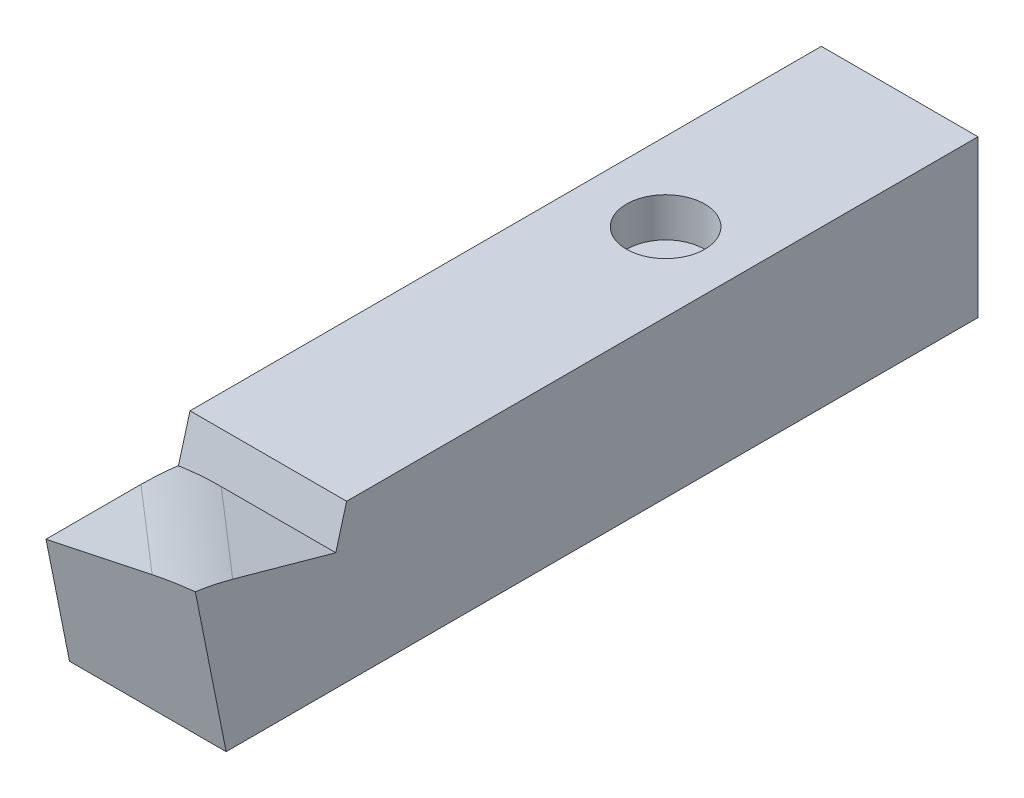
ISO-10303-21;
HEADER;
FILE_DESCRIPTION(('STEP AP214'),'2;1');
FILE_NAME('part.step','',(''),(''),'','','');
FILE_SCHEMA(('AUTOMOTIVE_DESIGN { 1 0 10303 214 1 1 1 1 }'));
ENDSEC;
DATA;
#1=APPLICATION_CONTEXT('core data for automotive mechanical design processes');
#2=APPLICATION_PROTOCOL_DEFINITION('international standard','automotive_design',2000,#1);
#3=PRODUCT_CONTEXT('',#1,'mechanical');
#4=PRODUCT('Part','Part','',(#3));
#5=PRODUCT_RELATED_PRODUCT_CATEGORY('part','',(#4));
#6=PRODUCT_DEFINITION_FORMATION('','',#4);
#7=PRODUCT_DEFINITION_CONTEXT('part definition',#1,'design');
#8=PRODUCT_DEFINITION('design','',#6,#7);
#9=PRODUCT_DEFINITION_SHAPE('','',#8);
#10=(LENGTH_UNIT() NAMED_UNIT(*) SI_UNIT(.MILLI.,.METRE.));
#11=(NAMED_UNIT(*) PLANE_ANGLE_UNIT() SI_UNIT($,.RADIAN.));
#12=(NAMED_UNIT(*) SI_UNIT($,.STERADIAN.) SOLID_ANGLE_UNIT());
#13=UNCERTAINTY_MEASURE_WITH_UNIT(LENGTH_MEASURE(1.E-05),#10,'distance_accuracy_value','');
#14=(GEOMETRIC_REPRESENTATION_CONTEXT(3) GLOBAL_UNCERTAINTY_ASSIGNED_CONTEXT((#13)) GLOBAL_UNIT_ASSIGNED_CONTEXT((#10,
#11,#12)) REPRESENTATION_CONTEXT('',''));
#15=CARTESIAN_POINT('',(0.,0.,0.));
#16=DIRECTION('',(0.,0.,1.));
#17=DIRECTION('',(1.,0.,0.));
#18=AXIS2_PLACEMENT_3D('',#15,#16,#17);
#19=CARTESIAN_POINT('',(10.,10.,-100.));
#20=DIRECTION('',(1.,0.,0.));
#21=DIRECTION('',(0.,0.,-1.));
#22=AXIS2_PLACEMENT_3D('',#19,#20,#21);
#23=PLANE('',#22);
#24=DIRECTION('',(0.,-0.267643863786095,-0.963517909629941));
#25=VECTOR('',#24,1.);
#26=CARTESIAN_POINT('',(10.,9.28366762177651,-2.57879656160459));
#27=LINE('',#26,#25);
#28=CARTESIAN_POINT('',(10.,8.65483006451051,-4.84261176776216));
#29=VERTEX_POINT('',#28);
#30=CARTESIAN_POINT('',(10.,5.,-18.));
#31=VERTEX_POINT('',#30);
#32=EDGE_CURVE('E199',#29,#31,#27,.T.);
#33=ORIENTED_EDGE('',*,*,#32,.F.);
#34=CARTESIAN_POINT('',(10.,-10.6155281280883,0.51026550795974));
#35=DIRECTION('',(1.,0.,0.));
#36=DIRECTION('',(0.,0.267643863786095,0.963517909629941));
#37=AXIS2_PLACEMENT_3D('',#34,#35,#36);
#38=ELLIPSE('',#37,27.367864366808,20.);
#39=CARTESIAN_POINT('',(10.,9.64998144961576,-0.0700037100768436));
#40=VERTEX_POINT('',#39);
#41=EDGE_CURVE('E134',#29,#40,#38,.T.);
#42=ORIENTED_EDGE('',*,*,#41,.T.);
#43=DIRECTION('',(0.,-0.98058067569092,-0.196116135138184));
#44=VECTOR('',#43,1.);
#45=CARTESIAN_POINT('',(10.,0.384615384615372,-1.92307692307692));
#46=LINE('',#45,#44);
#47=CARTESIAN_POINT('',(10.,-10.,-4.));
#48=VERTEX_POINT('',#47);
#49=EDGE_CURVE('E127',#40,#48,#46,.T.);
#50=ORIENTED_EDGE('',*,*,#49,.T.);
#51=DIRECTION('',(0.,0.,1.));
#52=VECTOR('',#51,1.);
#53=CARTESIAN_POINT('',(10.,-10.,-100.));
#54=LINE('',#53,#52);
#55=CARTESIAN_POINT('',(10.,-10.,-100.));
#56=VERTEX_POINT('',#55);
#57=EDGE_CURVE('E132',#56,#48,#54,.T.);
#58=ORIENTED_EDGE('',*,*,#57,.F.);
#59=DIRECTION('',(0.,1.,0.));
#60=VECTOR('',#59,1.);
#61=CARTESIAN_POINT('',(10.,10.,-100.));
#62=LINE('',#61,#60);
#63=CARTESIAN_POINT('',(10.,10.,-100.));
#64=VERTEX_POINT('',#63);
#65=EDGE_CURVE('E207',#56,#64,#62,.T.);
#66=ORIENTED_EDGE('',*,*,#65,.T.);
#67=DIRECTION('',(0.,0.,1.));
#68=VECTOR('',#67,1.);
#69=CARTESIAN_POINT('',(10.,10.,-100.));
#70=LINE('',#69,#68);
#71=CARTESIAN_POINT('',(10.,10.,-19.3888888888889));
#72=VERTEX_POINT('',#71);
#73=EDGE_CURVE('E171',#64,#72,#70,.T.);
#74=ORIENTED_EDGE('',*,*,#73,.T.);
#75=DIRECTION('',(0.,0.963517909629941,-0.267643863786094));
#76=VECTOR('',#75,1.);
#77=CARTESIAN_POINT('',(10.,-4.28366762177651,-15.4212034383954));
#78=LINE('',#77,#76);
#79=EDGE_CURVE('E209',#31,#72,#78,.T.);
#80=ORIENTED_EDGE('',*,*,#79,.F.);
#81=EDGE_LOOP('',(#33,#42,#50,#58,#66,#74,#80));
#82=FACE_BOUND('',#81,.T.);
#83=ADVANCED_FACE('F62',(#82),#23,.T.);
#84=CARTESIAN_POINT('',(-10.,-10.,-100.));
#85=DIRECTION('',(0.,-1.,0.));
#86=DIRECTION('',(0.,0.,-1.));
#87=AXIS2_PLACEMENT_3D('',#84,#85,#86);
#88=PLANE('',#87);
#89=ORIENTED_EDGE('',*,*,#57,.T.);
#90=DIRECTION('',(1.,0.,0.));
#91=VECTOR('',#90,1.);
#92=CARTESIAN_POINT('',(-10.,-10.,-4.));
#93=LINE('',#92,#91);
#94=CARTESIAN_POINT('',(-10.,-10.,-4.));
#95=VERTEX_POINT('',#94);
#96=EDGE_CURVE('E138',#95,#48,#93,.T.);
#97=ORIENTED_EDGE('',*,*,#96,.F.);
#98=DIRECTION('',(0.,0.,1.));
#99=VECTOR('',#98,1.);
#100=CARTESIAN_POINT('',(-10.,-10.,-100.));
#101=LINE('',#100,#99);
#102=CARTESIAN_POINT('',(-10.,-10.,-100.));
#103=VERTEX_POINT('',#102);
#104=EDGE_CURVE('E156',#103,#95,#101,.T.);
#105=ORIENTED_EDGE('',*,*,#104,.F.);
#106=DIRECTION('',(1.,0.,0.));
#107=VECTOR('',#106,1.);
#108=CARTESIAN_POINT('',(-10.,-10.,-100.));
#109=LINE('',#108,#107);
#110=EDGE_CURVE('E153',#103,#56,#109,.T.);
#111=ORIENTED_EDGE('',*,*,#110,.T.);
#112=EDGE_LOOP('',(#89,#97,#105,#111));
#113=FACE_BOUND('',#112,.T.);
#114=ADVANCED_FACE('F151',(#113),#88,.T.);
#115=CARTESIAN_POINT('',(-10.,10.,-100.));
#116=DIRECTION('',(-1.,0.,0.));
#117=DIRECTION('',(0.,-1.,0.));
#118=AXIS2_PLACEMENT_3D('',#115,#116,#117);
#119=PLANE('',#118);
#120=CARTESIAN_POINT('',(-10.,-15.6155281280883,-17.4897344920403));
#121=DIRECTION('',(-1.,0.,0.));
#122=DIRECTION('',(0.,0.267643863786095,0.963517909629941));
#123=AXIS2_PLACEMENT_3D('',#120,#121,#122);
#124=ELLIPSE('',#123,27.367864366808,20.);
#125=CARTESIAN_POINT('',(-10.,5.,-13.1240932413863));
#126=VERTEX_POINT('',#125);
#127=CARTESIAN_POINT('',(-10.,4.67226215837613,-17.90896171066));
#128=VERTEX_POINT('',#127);
#129=EDGE_CURVE('E71',#126,#128,#124,.T.);
#130=ORIENTED_EDGE('',*,*,#129,.T.);
#131=DIRECTION('',(0.,0.963517909629941,-0.267643863786094));
#132=VECTOR('',#131,1.);
#133=CARTESIAN_POINT('',(-10.,-4.28366762177651,-15.4212034383954));
#134=LINE('',#133,#132);
#135=CARTESIAN_POINT('',(-10.,10.,-19.3888888888889));
#136=VERTEX_POINT('',#135);
#137=EDGE_CURVE('E77',#128,#136,#134,.T.);
#138=ORIENTED_EDGE('',*,*,#137,.T.);
#139=DIRECTION('',(0.,0.,1.));
#140=VECTOR('',#139,1.);
#141=CARTESIAN_POINT('',(-10.,10.,-100.));
#142=LINE('',#141,#140);
#143=CARTESIAN_POINT('',(-10.,10.,-100.));
#144=VERTEX_POINT('',#143);
#145=EDGE_CURVE('E163',#144,#136,#142,.T.);
#146=ORIENTED_EDGE('',*,*,#145,.F.);
#147=DIRECTION('',(0.,-1.,0.));
#148=VECTOR('',#147,1.);
#149=CARTESIAN_POINT('',(-10.,10.,-100.));
#150=LINE('',#149,#148);
#151=EDGE_CURVE('E218',#144,#103,#150,.T.);
#152=ORIENTED_EDGE('',*,*,#151,.T.);
#153=ORIENTED_EDGE('',*,*,#104,.T.);
#154=DIRECTION('',(0.,-0.98058067569092,-0.196116135138184));
#155=VECTOR('',#154,1.);
#156=CARTESIAN_POINT('',(-10.,0.384615384615372,-1.92307692307692));
#157=LINE('',#156,#155);
#158=CARTESIAN_POINT('',(-10.,5.,-1.));
#159=VERTEX_POINT('',#158);
#160=EDGE_CURVE('E145',#159,#95,#157,.T.);
#161=ORIENTED_EDGE('',*,*,#160,.F.);
#162=DIRECTION('',(0.,0.,1.));
#163=VECTOR('',#162,1.);
#164=CARTESIAN_POINT('',(-10.,5.,-18.));
#165=LINE('',#164,#163);
#166=EDGE_CURVE('E139',#126,#159,#165,.T.);
#167=ORIENTED_EDGE('',*,*,#166,.F.);
#168=EDGE_LOOP('',(#130,#138,#146,#152,#153,#161,#167));
#169=FACE_BOUND('',#168,.T.);
#170=ADVANCED_FACE('F189',(#169),#119,.T.);
#171=CARTESIAN_POINT('',(-10.,10.,-100.));
#172=DIRECTION('',(0.,1.,0.));
#173=DIRECTION('',(0.,0.,1.));
#174=AXIS2_PLACEMENT_3D('',#171,#172,#173);
#175=PLANE('',#174);
#176=CARTESIAN_POINT('',(0.,10.,-70.1147084116696));
#177=DIRECTION('',(0.,1.,0.));
#178=DIRECTION('',(0.,0.,1.));
#179=AXIS2_PLACEMENT_3D('',#176,#177,#178);
#180=CIRCLE('',#179,5.);
#181=CARTESIAN_POINT('',(0.,10.,-65.1147084116696));
#182=VERTEX_POINT('',#181);
#183=EDGE_CURVE('E243',#182,#182,#180,.T.);
#184=ORIENTED_EDGE('',*,*,#183,.F.);
#185=EDGE_LOOP('',(#184));
#186=FACE_BOUND('',#185,.T.);
#187=DIRECTION('',(1.,0.,0.));
#188=VECTOR('',#187,1.);
#189=CARTESIAN_POINT('',(-10.,10.,-19.3888888888889));
#190=LINE('',#189,#188);
#191=EDGE_CURVE('E201',#136,#72,#190,.T.);
#192=ORIENTED_EDGE('',*,*,#191,.T.);
#193=ORIENTED_EDGE('',*,*,#73,.F.);
#194=DIRECTION('',(-1.,0.,0.));
#195=VECTOR('',#194,1.);
#196=CARTESIAN_POINT('',(-10.,10.,-100.));
#197=LINE('',#196,#195);
#198=EDGE_CURVE('E215',#64,#144,#197,.T.);
#199=ORIENTED_EDGE('',*,*,#198,.T.);
#200=ORIENTED_EDGE('',*,*,#145,.T.);
#201=EDGE_LOOP('',(#192,#193,#199,#200));
#202=FACE_BOUND('',#201,.T.);
#203=ADVANCED_FACE('F232',(#186,#202),#175,.T.);
#204=CARTESIAN_POINT('',(0.,0.,-100.));
#205=DIRECTION('',(0.,0.,1.));
#206=DIRECTION('',(1.,0.,0.));
#207=AXIS2_PLACEMENT_3D('',#204,#205,#206);
#208=PLANE('',#207);
#209=ORIENTED_EDGE('',*,*,#65,.F.);
#210=ORIENTED_EDGE('',*,*,#110,.F.);
#211=ORIENTED_EDGE('',*,*,#151,.F.);
#212=ORIENTED_EDGE('',*,*,#198,.F.);
#213=EDGE_LOOP('',(#209,#210,#211,#212));
#214=FACE_BOUND('',#213,.T.);
#215=ADVANCED_FACE('F230',(#214),#208,.F.);
#216=CARTESIAN_POINT('',(-10.,9.28366762177651,-2.57879656160459));
#217=DIRECTION('',(0.,-0.963517909629941,0.267643863786095));
#218=DIRECTION('',(0.,-0.267643863786095,-0.963517909629941));
#219=AXIS2_PLACEMENT_3D('',#216,#217,#218);
#220=PLANE('',#219);
#221=DIRECTION('',(1.,0.,0.));
#222=VECTOR('',#221,1.);
#223=CARTESIAN_POINT('',(-10.,5.,-18.));
#224=LINE('',#223,#222);
#225=CARTESIAN_POINT('',(-4.61932025804201,5.,-18.));
#226=VERTEX_POINT('',#225);
#227=EDGE_CURVE('E195',#226,#31,#224,.T.);
#228=ORIENTED_EDGE('',*,*,#227,.F.);
#229=DIRECTION('',(0.73078409524187,0.182696023810467,0.657705685717683));
#230=VECTOR('',#229,1.);
#231=CARTESIAN_POINT('',(0.491131148121937,6.27761285154099,-13.4005937344524));
#232=LINE('',#231,#230);
#233=EDGE_CURVE('E161',#226,#29,#232,.T.);
#234=ORIENTED_EDGE('',*,*,#233,.T.);
#235=ORIENTED_EDGE('',*,*,#32,.T.);
#236=EDGE_LOOP('',(#228,#234,#235));
#237=FACE_BOUND('',#236,.T.);
#238=ADVANCED_FACE('F198',(#237),#220,.F.);
#239=CARTESIAN_POINT('',(-10.,-4.28366762177651,-15.4212034383954));
#240=DIRECTION('',(0.,-0.267643863786094,-0.963517909629941));
#241=DIRECTION('',(0.,0.963517909629941,-0.267643863786094));
#242=AXIS2_PLACEMENT_3D('',#239,#240,#241);
#243=PLANE('',#242);
#244=ORIENTED_EDGE('',*,*,#79,.T.);
#245=ORIENTED_EDGE('',*,*,#191,.F.);
#246=ORIENTED_EDGE('',*,*,#137,.F.);
#247=CARTESIAN_POINT('',(-4.61932025804207,-14.2703581925988,-12.6471227242781));
#248=DIRECTION('',(0.,-0.267643863786094,-0.963517909629941));
#249=DIRECTION('',(1.,0.,0.));
#250=AXIS2_PLACEMENT_3D('',#247,#248,#249);
#251=ELLIPSE('',#250,29.2993638508251,20.);
#252=EDGE_CURVE('E12',#128,#226,#251,.T.);
#253=ORIENTED_EDGE('',*,*,#252,.T.);
#254=ORIENTED_EDGE('',*,*,#227,.T.);
#255=EDGE_LOOP('',(#244,#245,#246,#253,#254));
#256=FACE_BOUND('',#255,.T.);
#257=ADVANCED_FACE('F194',(#256),#243,.F.);
#258=CARTESIAN_POINT('',(-10.,0.384615384615372,-1.92307692307692));
#259=DIRECTION('',(0.,-0.196116135138184,0.98058067569092));
#260=DIRECTION('',(0.,-0.98058067569092,-0.196116135138184));
#261=AXIS2_PLACEMENT_3D('',#258,#259,#260);
#262=PLANE('',#261);
#263=ORIENTED_EDGE('',*,*,#49,.F.);
#264=CARTESIAN_POINT('',(4.54897513696778,-11.9782843438464,-4.39565686876928));
#265=DIRECTION('',(0.,-0.196116135138184,0.98058067569092));
#266=DIRECTION('',(0.921438496021943,0.380979378162919,0.0761958756325837));
#267=AXIS2_PLACEMENT_3D('',#264,#265,#266);
#268=ELLIPSE('',#267,32.8351234004035,20.);
#269=CARTESIAN_POINT('',(4.26363910751326,8.56590977687832,-0.286818044624326));
#270=VERTEX_POINT('',#269);
#271=EDGE_CURVE('E180',#40,#270,#268,.T.);
#272=ORIENTED_EDGE('',*,*,#271,.T.);
#273=DIRECTION('',(0.969003166223019,0.242250791555755,0.0484501583111509));
#274=VECTOR('',#273,1.);
#275=CARTESIAN_POINT('',(-11.1267605633803,4.71830985915492,-1.05633802816901));
#276=LINE('',#275,#274);
#277=EDGE_CURVE('E155',#159,#270,#276,.T.);
#278=ORIENTED_EDGE('',*,*,#277,.F.);
#279=ORIENTED_EDGE('',*,*,#160,.T.);
#280=ORIENTED_EDGE('',*,*,#96,.T.);
#281=EDGE_LOOP('',(#263,#272,#278,#279,#280));
#282=FACE_BOUND('',#281,.T.);
#283=ADVANCED_FACE('F142',(#282),#262,.T.);
#284=CARTESIAN_POINT('',(-10.,5.,-18.));
#285=DIRECTION('',(0.242535625036333,-0.970142500145332,0.));
#286=DIRECTION('',(0.970142500145332,0.242535625036333,0.));
#287=AXIS2_PLACEMENT_3D('',#284,#285,#286);
#288=PLANE('',#287);
#289=ORIENTED_EDGE('',*,*,#277,.T.);
#290=DIRECTION('',(0.73078409524187,0.182696023810467,0.657705685717683));
#291=VECTOR('',#290,1.);
#292=CARTESIAN_POINT('',(-12.343559990789,4.41411000230277,-15.2332972330964));
#293=LINE('',#292,#291);
#294=EDGE_CURVE('E85',#270,#126,#293,.F.);
#295=ORIENTED_EDGE('',*,*,#294,.T.);
#296=ORIENTED_EDGE('',*,*,#166,.T.);
#297=EDGE_LOOP('',(#289,#295,#296));
#298=FACE_BOUND('',#297,.T.);
#299=ADVANCED_FACE('F282',(#298),#288,.F.);
#300=CARTESIAN_POINT('',(0.491131148121937,-12.9927453410578,-8.04771645873054));
#301=DIRECTION('',(0.73078409524187,0.182696023810467,0.657705685717683));
#302=DIRECTION('',(0.66896473162245,0.,-0.743294146247166));
#303=AXIS2_PLACEMENT_3D('',#300,#301,#302);
#304=CYLINDRICAL_SURFACE('',#303,20.);
#305=ORIENTED_EDGE('',*,*,#129,.F.);
#306=ORIENTED_EDGE('',*,*,#294,.F.);
#307=ORIENTED_EDGE('',*,*,#271,.F.);
#308=ORIENTED_EDGE('',*,*,#41,.F.);
#309=ORIENTED_EDGE('',*,*,#233,.F.);
#310=ORIENTED_EDGE('',*,*,#252,.F.);
#311=EDGE_LOOP('',(#305,#306,#307,#308,#309,#310));
#312=FACE_BOUND('',#311,.T.);
#313=ADVANCED_FACE('F64',(#312),#304,.T.);
#314=CARTESIAN_POINT('',(0.,5.,-70.1147084116696));
#315=DIRECTION('',(0.,1.,0.));
#316=DIRECTION('',(0.,0.,1.));
#317=AXIS2_PLACEMENT_3D('',#314,#315,#316);
#318=CYLINDRICAL_SURFACE('',#317,5.);
#319=CARTESIAN_POINT('',(0.,5.,-70.1147084116696));
#320=DIRECTION('',(0.,1.,0.));
#321=DIRECTION('',(0.,0.,1.));
#322=AXIS2_PLACEMENT_3D('',#319,#320,#321);
#323=CIRCLE('',#322,5.);
#324=CARTESIAN_POINT('',(0.,5.,-65.1147084116696));
#325=VERTEX_POINT('',#324);
#326=EDGE_CURVE('E242',#325,#325,#323,.T.);
#327=ORIENTED_EDGE('',*,*,#326,.F.);
#328=EDGE_LOOP('',(#327));
#329=FACE_BOUND('',#328,.T.);
#330=ORIENTED_EDGE('',*,*,#183,.T.);
#331=EDGE_LOOP('',(#330));
#332=FACE_BOUND('',#331,.T.);
#333=ADVANCED_FACE('F254',(#329,#332),#318,.F.);
#334=CARTESIAN_POINT('',(0.,5.,-70.1147084116696));
#335=DIRECTION('',(0.,1.,0.));
#336=DIRECTION('',(0.,0.,1.));
#337=AXIS2_PLACEMENT_3D('',#334,#335,#336);
#338=PLANE('',#337);
#339=ORIENTED_EDGE('',*,*,#326,.T.);
#340=EDGE_LOOP('',(#339));
#341=FACE_BOUND('',#340,.T.);
#342=ADVANCED_FACE('F252',(#341),#338,.T.);
#343=CLOSED_SHELL('',(#83,#114,#170,#203,#215,#238,#257,#283,#299,#313,#333,#342));
#344=MANIFOLD_SOLID_BREP('B2',#343);
#345=ADVANCED_BREP_SHAPE_REPRESENTATION('',(#18,#344),#14);
#346=SHAPE_DEFINITION_REPRESENTATION(#9,#345);
ENDSEC;
END-ISO-10303-21;
